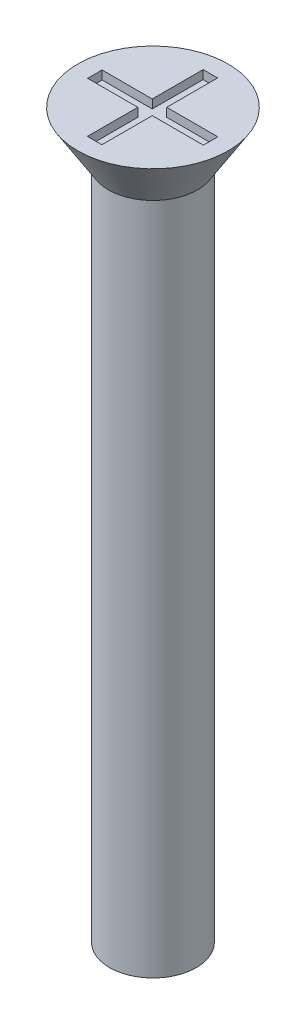
ISO-10303-21;
HEADER;
FILE_DESCRIPTION(('STEP AP214'),'2;1');
FILE_NAME('part.step','',(''),(''),'','','');
FILE_SCHEMA(('AUTOMOTIVE_DESIGN { 1 0 10303 214 1 1 1 1 }'));
ENDSEC;
DATA;
#1=APPLICATION_CONTEXT('core data for automotive mechanical design processes');
#2=APPLICATION_PROTOCOL_DEFINITION('international standard','automotive_design',2000,#1);
#3=PRODUCT_CONTEXT('',#1,'mechanical');
#4=PRODUCT('Part','Part','',(#3));
#5=PRODUCT_RELATED_PRODUCT_CATEGORY('part','',(#4));
#6=PRODUCT_DEFINITION_FORMATION('','',#4);
#7=PRODUCT_DEFINITION_CONTEXT('part definition',#1,'design');
#8=PRODUCT_DEFINITION('design','',#6,#7);
#9=PRODUCT_DEFINITION_SHAPE('','',#8);
#10=(LENGTH_UNIT() NAMED_UNIT(*) SI_UNIT(.MILLI.,.METRE.));
#11=(NAMED_UNIT(*) PLANE_ANGLE_UNIT() SI_UNIT($,.RADIAN.));
#12=(NAMED_UNIT(*) SI_UNIT($,.STERADIAN.) SOLID_ANGLE_UNIT());
#13=UNCERTAINTY_MEASURE_WITH_UNIT(LENGTH_MEASURE(1.E-05),#10,'distance_accuracy_value','');
#14=(GEOMETRIC_REPRESENTATION_CONTEXT(3) GLOBAL_UNCERTAINTY_ASSIGNED_CONTEXT((#13)) GLOBAL_UNIT_ASSIGNED_CONTEXT((#10,
#11,#12)) REPRESENTATION_CONTEXT('',''));
#15=CARTESIAN_POINT('',(0.,0.,0.));
#16=DIRECTION('',(0.,0.,1.));
#17=DIRECTION('',(1.,0.,0.));
#18=AXIS2_PLACEMENT_3D('',#15,#16,#17);
#19=CARTESIAN_POINT('',(0.,25.,0.));
#20=DIRECTION('',(0.,1.,0.));
#21=DIRECTION('',(0.,0.,1.));
#22=AXIS2_PLACEMENT_3D('',#19,#20,#21);
#23=PLANE('',#22);
#24=CARTESIAN_POINT('',(0.,25.,0.));
#25=DIRECTION('',(0.,1.,0.));
#26=DIRECTION('',(0.,0.,1.));
#27=AXIS2_PLACEMENT_3D('',#24,#25,#26);
#28=CIRCLE('',#27,2.6);
#29=CARTESIAN_POINT('',(0.,25.,2.6));
#30=VERTEX_POINT('',#29);
#31=EDGE_CURVE('E192',#30,#30,#28,.T.);
#32=ORIENTED_EDGE('',*,*,#31,.T.);
#33=EDGE_LOOP('',(#32));
#34=FACE_BOUND('',#33,.T.);
#35=DIRECTION('',(1.,0.,0.));
#36=VECTOR('',#35,1.);
#37=CARTESIAN_POINT('',(0.,25.,-2.));
#38=LINE('',#37,#36);
#39=CARTESIAN_POINT('',(-0.265272843023468,25.,-2.));
#40=VERTEX_POINT('',#39);
#41=CARTESIAN_POINT('',(0.234727156976532,25.,-2.));
#42=VERTEX_POINT('',#41);
#43=EDGE_CURVE('E161',#40,#42,#38,.T.);
#44=ORIENTED_EDGE('',*,*,#43,.T.);
#45=DIRECTION('',(0.,0.,1.));
#46=VECTOR('',#45,1.);
#47=CARTESIAN_POINT('',(0.234727156976532,25.,0.));
#48=LINE('',#47,#46);
#49=CARTESIAN_POINT('',(0.234727156976532,25.,-0.241621514992573));
#50=VERTEX_POINT('',#49);
#51=EDGE_CURVE('E48',#42,#50,#48,.T.);
#52=ORIENTED_EDGE('',*,*,#51,.T.);
#53=DIRECTION('',(1.,0.,0.));
#54=VECTOR('',#53,1.);
#55=CARTESIAN_POINT('',(0.,25.,-0.241621514992573));
#56=LINE('',#55,#54);
#57=CARTESIAN_POINT('',(2.,25.,-0.241621514992573));
#58=VERTEX_POINT('',#57);
#59=EDGE_CURVE('E98',#50,#58,#56,.T.);
#60=ORIENTED_EDGE('',*,*,#59,.T.);
#61=DIRECTION('',(0.,0.,1.));
#62=VECTOR('',#61,1.);
#63=CARTESIAN_POINT('',(2.,25.,0.));
#64=LINE('',#63,#62);
#65=CARTESIAN_POINT('',(2.,25.,0.258378485007427));
#66=VERTEX_POINT('',#65);
#67=EDGE_CURVE('E186',#58,#66,#64,.T.);
#68=ORIENTED_EDGE('',*,*,#67,.T.);
#69=DIRECTION('',(1.,0.,0.));
#70=VECTOR('',#69,1.);
#71=CARTESIAN_POINT('',(0.,25.,0.258378485007427));
#72=LINE('',#71,#70);
#73=CARTESIAN_POINT('',(0.234727156976532,25.,0.258378485007427));
#74=VERTEX_POINT('',#73);
#75=EDGE_CURVE('E145',#74,#66,#72,.T.);
#76=ORIENTED_EDGE('',*,*,#75,.F.);
#77=DIRECTION('',(0.,0.,1.));
#78=VECTOR('',#77,1.);
#79=CARTESIAN_POINT('',(0.234727156976532,25.,0.));
#80=LINE('',#79,#78);
#81=CARTESIAN_POINT('',(0.234727156976533,25.,2.));
#82=VERTEX_POINT('',#81);
#83=EDGE_CURVE('E182',#74,#82,#80,.T.);
#84=ORIENTED_EDGE('',*,*,#83,.T.);
#85=DIRECTION('',(1.,0.,0.));
#86=VECTOR('',#85,1.);
#87=CARTESIAN_POINT('',(0.,25.,2.));
#88=LINE('',#87,#86);
#89=CARTESIAN_POINT('',(-0.265272843023467,25.,2.));
#90=VERTEX_POINT('',#89);
#91=EDGE_CURVE('E179',#90,#82,#88,.T.);
#92=ORIENTED_EDGE('',*,*,#91,.F.);
#93=DIRECTION('',(0.,0.,1.));
#94=VECTOR('',#93,1.);
#95=CARTESIAN_POINT('',(-0.265272843023468,25.,0.));
#96=LINE('',#95,#94);
#97=CARTESIAN_POINT('',(-0.265272843023468,25.,0.258378485007427));
#98=VERTEX_POINT('',#97);
#99=EDGE_CURVE('E176',#98,#90,#96,.T.);
#100=ORIENTED_EDGE('',*,*,#99,.F.);
#101=DIRECTION('',(1.,0.,0.));
#102=VECTOR('',#101,1.);
#103=CARTESIAN_POINT('',(0.,25.,0.258378485007427));
#104=LINE('',#103,#102);
#105=CARTESIAN_POINT('',(-2.,25.,0.258378485007427));
#106=VERTEX_POINT('',#105);
#107=EDGE_CURVE('E173',#106,#98,#104,.T.);
#108=ORIENTED_EDGE('',*,*,#107,.F.);
#109=DIRECTION('',(0.,0.,1.));
#110=VECTOR('',#109,1.);
#111=CARTESIAN_POINT('',(-2.,25.,0.));
#112=LINE('',#111,#110);
#113=CARTESIAN_POINT('',(-2.,25.,-0.241621514992573));
#114=VERTEX_POINT('',#113);
#115=EDGE_CURVE('E170',#114,#106,#112,.T.);
#116=ORIENTED_EDGE('',*,*,#115,.F.);
#117=DIRECTION('',(1.,0.,0.));
#118=VECTOR('',#117,1.);
#119=CARTESIAN_POINT('',(0.,25.,-0.241621514992573));
#120=LINE('',#119,#118);
#121=CARTESIAN_POINT('',(-0.265272843023468,25.,-0.241621514992573));
#122=VERTEX_POINT('',#121);
#123=EDGE_CURVE('E167',#114,#122,#120,.T.);
#124=ORIENTED_EDGE('',*,*,#123,.T.);
#125=DIRECTION('',(0.,0.,1.));
#126=VECTOR('',#125,1.);
#127=CARTESIAN_POINT('',(-0.265272843023468,25.,0.));
#128=LINE('',#127,#126);
#129=EDGE_CURVE('E164',#40,#122,#128,.T.);
#130=ORIENTED_EDGE('',*,*,#129,.F.);
#131=EDGE_LOOP('',(#44,#52,#60,#68,#76,#84,#92,#100,#108,#116,#124,#130));
#132=FACE_BOUND('',#131,.T.);
#133=ADVANCED_FACE('F33',(#34,#132),#23,.T.);
#134=CARTESIAN_POINT('',(0.,25.,0.));
#135=DIRECTION('',(0.,-1.,0.));
#136=DIRECTION('',(0.,0.,-1.));
#137=AXIS2_PLACEMENT_3D('',#134,#135,#136);
#138=CYLINDRICAL_SURFACE('',#137,1.5);
#139=CARTESIAN_POINT('',(0.,0.,0.));
#140=DIRECTION('',(0.,1.,0.));
#141=DIRECTION('',(0.,0.,1.));
#142=AXIS2_PLACEMENT_3D('',#139,#140,#141);
#143=CIRCLE('',#142,1.5);
#144=CARTESIAN_POINT('',(0.,0.,1.5));
#145=VERTEX_POINT('',#144);
#146=EDGE_CURVE('E41',#145,#145,#143,.T.);
#147=ORIENTED_EDGE('',*,*,#146,.T.);
#148=EDGE_LOOP('',(#147));
#149=FACE_BOUND('',#148,.T.);
#150=CARTESIAN_POINT('',(0.,23.3,0.));
#151=DIRECTION('',(0.,1.,0.));
#152=DIRECTION('',(0.,0.,1.));
#153=AXIS2_PLACEMENT_3D('',#150,#151,#152);
#154=CIRCLE('',#153,1.5);
#155=CARTESIAN_POINT('',(0.,23.3,1.5));
#156=VERTEX_POINT('',#155);
#157=EDGE_CURVE('E11',#156,#156,#154,.T.);
#158=ORIENTED_EDGE('',*,*,#157,.F.);
#159=EDGE_LOOP('',(#158));
#160=FACE_BOUND('',#159,.T.);
#161=ADVANCED_FACE('F35',(#149,#160),#138,.T.);
#162=CARTESIAN_POINT('',(0.,0.,0.));
#163=DIRECTION('',(0.,1.,0.));
#164=DIRECTION('',(0.,0.,1.));
#165=AXIS2_PLACEMENT_3D('',#162,#163,#164);
#166=PLANE('',#165);
#167=ORIENTED_EDGE('',*,*,#146,.F.);
#168=EDGE_LOOP('',(#167));
#169=FACE_BOUND('',#168,.T.);
#170=ADVANCED_FACE('F219',(#169),#166,.F.);
#171=CARTESIAN_POINT('',(0.,25.,0.));
#172=DIRECTION('',(0.,1.,0.));
#173=DIRECTION('',(0.,0.,1.));
#174=AXIS2_PLACEMENT_3D('',#171,#172,#173);
#175=CONICAL_SURFACE('',#174,2.6,0.558505360638187);
#176=CARTESIAN_POINT('',(0.,23.3,0.));
#177=DIRECTION('',(0.,1.,0.));
#178=DIRECTION('',(0.,0.,1.));
#179=AXIS2_PLACEMENT_3D('',#176,#177,#178);
#180=CIRCLE('',#179,1.53772210175414);
#181=CARTESIAN_POINT('',(0.,23.3,1.53772210175414));
#182=VERTEX_POINT('',#181);
#183=EDGE_CURVE('E212',#182,#182,#180,.T.);
#184=ORIENTED_EDGE('',*,*,#183,.T.);
#185=EDGE_LOOP('',(#184));
#186=FACE_BOUND('',#185,.T.);
#187=ORIENTED_EDGE('',*,*,#31,.F.);
#188=EDGE_LOOP('',(#187));
#189=FACE_BOUND('',#188,.T.);
#190=ADVANCED_FACE('F221',(#186,#189),#175,.T.);
#191=CARTESIAN_POINT('',(0.,23.3,0.));
#192=DIRECTION('',(0.,1.,0.));
#193=DIRECTION('',(0.,0.,1.));
#194=AXIS2_PLACEMENT_3D('',#191,#192,#193);
#195=PLANE('',#194);
#196=ORIENTED_EDGE('',*,*,#157,.T.);
#197=EDGE_LOOP('',(#196));
#198=FACE_BOUND('',#197,.T.);
#199=ORIENTED_EDGE('',*,*,#183,.F.);
#200=EDGE_LOOP('',(#199));
#201=FACE_BOUND('',#200,.T.);
#202=ADVANCED_FACE('F226',(#198,#201),#195,.F.);
#203=CARTESIAN_POINT('',(0.234727156976532,24.7,0.));
#204=DIRECTION('',(-1.,0.,0.));
#205=DIRECTION('',(0.,0.,1.));
#206=AXIS2_PLACEMENT_3D('',#203,#204,#205);
#207=PLANE('',#206);
#208=ORIENTED_EDGE('',*,*,#51,.F.);
#209=DIRECTION('',(0.,1.,0.));
#210=VECTOR('',#209,1.);
#211=CARTESIAN_POINT('',(0.234727156976532,24.7,-2.));
#212=LINE('',#211,#210);
#213=CARTESIAN_POINT('',(0.234727156976532,24.7,-2.));
#214=VERTEX_POINT('',#213);
#215=EDGE_CURVE('E159',#214,#42,#212,.T.);
#216=ORIENTED_EDGE('',*,*,#215,.F.);
#217=DIRECTION('',(0.,0.,1.));
#218=VECTOR('',#217,1.);
#219=CARTESIAN_POINT('',(0.234727156976532,24.7,0.));
#220=LINE('',#219,#218);
#221=CARTESIAN_POINT('',(0.234727156976532,24.7,-0.241621514992573));
#222=VERTEX_POINT('',#221);
#223=EDGE_CURVE('E189',#214,#222,#220,.T.);
#224=ORIENTED_EDGE('',*,*,#223,.T.);
#225=DIRECTION('',(0.,1.,0.));
#226=VECTOR('',#225,1.);
#227=CARTESIAN_POINT('',(0.234727156976532,24.7,-0.241621514992573));
#228=LINE('',#227,#226);
#229=EDGE_CURVE('E190',#222,#50,#228,.T.);
#230=ORIENTED_EDGE('',*,*,#229,.T.);
#231=EDGE_LOOP('',(#208,#216,#224,#230));
#232=FACE_BOUND('',#231,.T.);
#233=ADVANCED_FACE('F238',(#232),#207,.T.);
#234=CARTESIAN_POINT('',(0.,24.7,-0.241621514992573));
#235=DIRECTION('',(0.,0.,1.));
#236=DIRECTION('',(1.,0.,0.));
#237=AXIS2_PLACEMENT_3D('',#234,#235,#236);
#238=PLANE('',#237);
#239=ORIENTED_EDGE('',*,*,#59,.F.);
#240=ORIENTED_EDGE('',*,*,#229,.F.);
#241=DIRECTION('',(1.,0.,0.));
#242=VECTOR('',#241,1.);
#243=CARTESIAN_POINT('',(0.,24.7,-0.241621514992573));
#244=LINE('',#243,#242);
#245=CARTESIAN_POINT('',(2.,24.7,-0.241621514992573));
#246=VERTEX_POINT('',#245);
#247=EDGE_CURVE('E57',#222,#246,#244,.T.);
#248=ORIENTED_EDGE('',*,*,#247,.T.);
#249=DIRECTION('',(0.,1.,0.));
#250=VECTOR('',#249,1.);
#251=CARTESIAN_POINT('',(2.,24.7,-0.241621514992573));
#252=LINE('',#251,#250);
#253=EDGE_CURVE('E137',#246,#58,#252,.T.);
#254=ORIENTED_EDGE('',*,*,#253,.T.);
#255=EDGE_LOOP('',(#239,#240,#248,#254));
#256=FACE_BOUND('',#255,.T.);
#257=ADVANCED_FACE('F242',(#256),#238,.T.);
#258=CARTESIAN_POINT('',(2.,24.7,0.));
#259=DIRECTION('',(-1.,0.,0.));
#260=DIRECTION('',(0.,0.,1.));
#261=AXIS2_PLACEMENT_3D('',#258,#259,#260);
#262=PLANE('',#261);
#263=ORIENTED_EDGE('',*,*,#67,.F.);
#264=ORIENTED_EDGE('',*,*,#253,.F.);
#265=DIRECTION('',(0.,0.,1.));
#266=VECTOR('',#265,1.);
#267=CARTESIAN_POINT('',(2.,24.7,0.));
#268=LINE('',#267,#266);
#269=CARTESIAN_POINT('',(2.,24.7,0.258378485007427));
#270=VERTEX_POINT('',#269);
#271=EDGE_CURVE('E131',#246,#270,#268,.T.);
#272=ORIENTED_EDGE('',*,*,#271,.T.);
#273=DIRECTION('',(0.,1.,0.));
#274=VECTOR('',#273,1.);
#275=CARTESIAN_POINT('',(2.,24.7,0.258378485007427));
#276=LINE('',#275,#274);
#277=EDGE_CURVE('E135',#270,#66,#276,.T.);
#278=ORIENTED_EDGE('',*,*,#277,.T.);
#279=EDGE_LOOP('',(#263,#264,#272,#278));
#280=FACE_BOUND('',#279,.T.);
#281=ADVANCED_FACE('F134',(#280),#262,.T.);
#282=CARTESIAN_POINT('',(0.,24.7,0.258378485007427));
#283=DIRECTION('',(0.,0.,1.));
#284=DIRECTION('',(1.,0.,0.));
#285=AXIS2_PLACEMENT_3D('',#282,#283,#284);
#286=PLANE('',#285);
#287=ORIENTED_EDGE('',*,*,#75,.T.);
#288=ORIENTED_EDGE('',*,*,#277,.F.);
#289=DIRECTION('',(1.,0.,0.));
#290=VECTOR('',#289,1.);
#291=CARTESIAN_POINT('',(0.,24.7,0.258378485007427));
#292=LINE('',#291,#290);
#293=CARTESIAN_POINT('',(0.234727156976532,24.7,0.258378485007427));
#294=VERTEX_POINT('',#293);
#295=EDGE_CURVE('E139',#294,#270,#292,.T.);
#296=ORIENTED_EDGE('',*,*,#295,.F.);
#297=DIRECTION('',(0.,1.,0.));
#298=VECTOR('',#297,1.);
#299=CARTESIAN_POINT('',(0.234727156976532,24.7,0.258378485007427));
#300=LINE('',#299,#298);
#301=EDGE_CURVE('E147',#294,#74,#300,.T.);
#302=ORIENTED_EDGE('',*,*,#301,.T.);
#303=EDGE_LOOP('',(#287,#288,#296,#302));
#304=FACE_BOUND('',#303,.T.);
#305=ADVANCED_FACE('F143',(#304),#286,.F.);
#306=CARTESIAN_POINT('',(0.234727156976532,24.7,0.));
#307=DIRECTION('',(-1.,0.,0.));
#308=DIRECTION('',(0.,0.,1.));
#309=AXIS2_PLACEMENT_3D('',#306,#307,#308);
#310=PLANE('',#309);
#311=ORIENTED_EDGE('',*,*,#83,.F.);
#312=ORIENTED_EDGE('',*,*,#301,.F.);
#313=DIRECTION('',(0.,0.,1.));
#314=VECTOR('',#313,1.);
#315=CARTESIAN_POINT('',(0.234727156976532,24.7,0.));
#316=LINE('',#315,#314);
#317=CARTESIAN_POINT('',(0.234727156976533,24.7,2.));
#318=VERTEX_POINT('',#317);
#319=EDGE_CURVE('E152',#294,#318,#316,.T.);
#320=ORIENTED_EDGE('',*,*,#319,.T.);
#321=DIRECTION('',(0.,1.,0.));
#322=VECTOR('',#321,1.);
#323=CARTESIAN_POINT('',(0.234727156976533,24.7,2.));
#324=LINE('',#323,#322);
#325=EDGE_CURVE('E195',#318,#82,#324,.T.);
#326=ORIENTED_EDGE('',*,*,#325,.T.);
#327=EDGE_LOOP('',(#311,#312,#320,#326));
#328=FACE_BOUND('',#327,.T.);
#329=ADVANCED_FACE('F269',(#328),#310,.T.);
#330=CARTESIAN_POINT('',(0.,24.7,2.));
#331=DIRECTION('',(0.,0.,1.));
#332=DIRECTION('',(1.,0.,0.));
#333=AXIS2_PLACEMENT_3D('',#330,#331,#332);
#334=PLANE('',#333);
#335=ORIENTED_EDGE('',*,*,#91,.T.);
#336=ORIENTED_EDGE('',*,*,#325,.F.);
#337=DIRECTION('',(1.,0.,0.));
#338=VECTOR('',#337,1.);
#339=CARTESIAN_POINT('',(0.,24.7,2.));
#340=LINE('',#339,#338);
#341=CARTESIAN_POINT('',(-0.265272843023467,24.7,2.));
#342=VERTEX_POINT('',#341);
#343=EDGE_CURVE('E154',#342,#318,#340,.T.);
#344=ORIENTED_EDGE('',*,*,#343,.F.);
#345=DIRECTION('',(0.,1.,0.));
#346=VECTOR('',#345,1.);
#347=CARTESIAN_POINT('',(-0.265272843023467,24.7,2.));
#348=LINE('',#347,#346);
#349=EDGE_CURVE('E197',#342,#90,#348,.T.);
#350=ORIENTED_EDGE('',*,*,#349,.T.);
#351=EDGE_LOOP('',(#335,#336,#344,#350));
#352=FACE_BOUND('',#351,.T.);
#353=ADVANCED_FACE('F265',(#352),#334,.F.);
#354=CARTESIAN_POINT('',(-0.265272843023468,24.7,0.));
#355=DIRECTION('',(-1.,0.,0.));
#356=DIRECTION('',(0.,0.,1.));
#357=AXIS2_PLACEMENT_3D('',#354,#355,#356);
#358=PLANE('',#357);
#359=ORIENTED_EDGE('',*,*,#99,.T.);
#360=ORIENTED_EDGE('',*,*,#349,.F.);
#361=DIRECTION('',(0.,0.,1.));
#362=VECTOR('',#361,1.);
#363=CARTESIAN_POINT('',(-0.265272843023468,24.7,0.));
#364=LINE('',#363,#362);
#365=CARTESIAN_POINT('',(-0.265272843023468,24.7,0.258378485007427));
#366=VERTEX_POINT('',#365);
#367=EDGE_CURVE('E417',#366,#342,#364,.T.);
#368=ORIENTED_EDGE('',*,*,#367,.F.);
#369=DIRECTION('',(0.,1.,0.));
#370=VECTOR('',#369,1.);
#371=CARTESIAN_POINT('',(-0.265272843023468,24.7,0.258378485007427));
#372=LINE('',#371,#370);
#373=EDGE_CURVE('E199',#366,#98,#372,.T.);
#374=ORIENTED_EDGE('',*,*,#373,.T.);
#375=EDGE_LOOP('',(#359,#360,#368,#374));
#376=FACE_BOUND('',#375,.T.);
#377=ADVANCED_FACE('F261',(#376),#358,.F.);
#378=CARTESIAN_POINT('',(0.,24.7,0.258378485007427));
#379=DIRECTION('',(0.,0.,1.));
#380=DIRECTION('',(1.,0.,0.));
#381=AXIS2_PLACEMENT_3D('',#378,#379,#380);
#382=PLANE('',#381);
#383=ORIENTED_EDGE('',*,*,#107,.T.);
#384=ORIENTED_EDGE('',*,*,#373,.F.);
#385=DIRECTION('',(1.,0.,0.));
#386=VECTOR('',#385,1.);
#387=CARTESIAN_POINT('',(0.,24.7,0.258378485007427));
#388=LINE('',#387,#386);
#389=CARTESIAN_POINT('',(-2.,24.7,0.258378485007427));
#390=VERTEX_POINT('',#389);
#391=EDGE_CURVE('E414',#390,#366,#388,.T.);
#392=ORIENTED_EDGE('',*,*,#391,.F.);
#393=DIRECTION('',(0.,1.,0.));
#394=VECTOR('',#393,1.);
#395=CARTESIAN_POINT('',(-2.,24.7,0.258378485007427));
#396=LINE('',#395,#394);
#397=EDGE_CURVE('E201',#390,#106,#396,.T.);
#398=ORIENTED_EDGE('',*,*,#397,.T.);
#399=EDGE_LOOP('',(#383,#384,#392,#398));
#400=FACE_BOUND('',#399,.T.);
#401=ADVANCED_FACE('F257',(#400),#382,.F.);
#402=CARTESIAN_POINT('',(-2.,24.7,0.));
#403=DIRECTION('',(-1.,0.,0.));
#404=DIRECTION('',(0.,0.,1.));
#405=AXIS2_PLACEMENT_3D('',#402,#403,#404);
#406=PLANE('',#405);
#407=ORIENTED_EDGE('',*,*,#115,.T.);
#408=ORIENTED_EDGE('',*,*,#397,.F.);
#409=DIRECTION('',(0.,0.,1.));
#410=VECTOR('',#409,1.);
#411=CARTESIAN_POINT('',(-2.,24.7,0.));
#412=LINE('',#411,#410);
#413=CARTESIAN_POINT('',(-2.,24.7,-0.241621514992573));
#414=VERTEX_POINT('',#413);
#415=EDGE_CURVE('E411',#414,#390,#412,.T.);
#416=ORIENTED_EDGE('',*,*,#415,.F.);
#417=DIRECTION('',(0.,1.,0.));
#418=VECTOR('',#417,1.);
#419=CARTESIAN_POINT('',(-2.,24.7,-0.241621514992573));
#420=LINE('',#419,#418);
#421=EDGE_CURVE('E203',#414,#114,#420,.T.);
#422=ORIENTED_EDGE('',*,*,#421,.T.);
#423=EDGE_LOOP('',(#407,#408,#416,#422));
#424=FACE_BOUND('',#423,.T.);
#425=ADVANCED_FACE('F253',(#424),#406,.F.);
#426=CARTESIAN_POINT('',(0.,24.7,-0.241621514992573));
#427=DIRECTION('',(0.,0.,1.));
#428=DIRECTION('',(1.,0.,0.));
#429=AXIS2_PLACEMENT_3D('',#426,#427,#428);
#430=PLANE('',#429);
#431=ORIENTED_EDGE('',*,*,#123,.F.);
#432=ORIENTED_EDGE('',*,*,#421,.F.);
#433=DIRECTION('',(1.,0.,0.));
#434=VECTOR('',#433,1.);
#435=CARTESIAN_POINT('',(0.,24.7,-0.241621514992573));
#436=LINE('',#435,#434);
#437=CARTESIAN_POINT('',(-0.265272843023468,24.7,-0.241621514992573));
#438=VERTEX_POINT('',#437);
#439=EDGE_CURVE('E409',#414,#438,#436,.T.);
#440=ORIENTED_EDGE('',*,*,#439,.T.);
#441=DIRECTION('',(0.,1.,0.));
#442=VECTOR('',#441,1.);
#443=CARTESIAN_POINT('',(-0.265272843023468,24.7,-0.241621514992573));
#444=LINE('',#443,#442);
#445=EDGE_CURVE('E205',#438,#122,#444,.T.);
#446=ORIENTED_EDGE('',*,*,#445,.T.);
#447=EDGE_LOOP('',(#431,#432,#440,#446));
#448=FACE_BOUND('',#447,.T.);
#449=ADVANCED_FACE('F249',(#448),#430,.T.);
#450=CARTESIAN_POINT('',(-0.265272843023468,24.7,0.));
#451=DIRECTION('',(-1.,0.,0.));
#452=DIRECTION('',(0.,0.,1.));
#453=AXIS2_PLACEMENT_3D('',#450,#451,#452);
#454=PLANE('',#453);
#455=ORIENTED_EDGE('',*,*,#129,.T.);
#456=ORIENTED_EDGE('',*,*,#445,.F.);
#457=DIRECTION('',(0.,0.,1.));
#458=VECTOR('',#457,1.);
#459=CARTESIAN_POINT('',(-0.265272843023468,24.7,0.));
#460=LINE('',#459,#458);
#461=CARTESIAN_POINT('',(-0.265272843023468,24.7,-2.));
#462=VERTEX_POINT('',#461);
#463=EDGE_CURVE('E405',#462,#438,#460,.T.);
#464=ORIENTED_EDGE('',*,*,#463,.F.);
#465=DIRECTION('',(0.,1.,0.));
#466=VECTOR('',#465,1.);
#467=CARTESIAN_POINT('',(-0.265272843023468,24.7,-2.));
#468=LINE('',#467,#466);
#469=EDGE_CURVE('E207',#462,#40,#468,.T.);
#470=ORIENTED_EDGE('',*,*,#469,.T.);
#471=EDGE_LOOP('',(#455,#456,#464,#470));
#472=FACE_BOUND('',#471,.T.);
#473=ADVANCED_FACE('F246',(#472),#454,.F.);
#474=CARTESIAN_POINT('',(0.,24.7,-2.));
#475=DIRECTION('',(0.,0.,1.));
#476=DIRECTION('',(1.,0.,0.));
#477=AXIS2_PLACEMENT_3D('',#474,#475,#476);
#478=PLANE('',#477);
#479=ORIENTED_EDGE('',*,*,#43,.F.);
#480=ORIENTED_EDGE('',*,*,#469,.F.);
#481=DIRECTION('',(1.,0.,0.));
#482=VECTOR('',#481,1.);
#483=CARTESIAN_POINT('',(0.,24.7,-2.));
#484=LINE('',#483,#482);
#485=EDGE_CURVE('E105',#462,#214,#484,.T.);
#486=ORIENTED_EDGE('',*,*,#485,.T.);
#487=ORIENTED_EDGE('',*,*,#215,.T.);
#488=EDGE_LOOP('',(#479,#480,#486,#487));
#489=FACE_BOUND('',#488,.T.);
#490=ADVANCED_FACE('F243',(#489),#478,.T.);
#491=CARTESIAN_POINT('',(0.,24.7,0.));
#492=DIRECTION('',(0.,1.,0.));
#493=DIRECTION('',(0.,0.,1.));
#494=AXIS2_PLACEMENT_3D('',#491,#492,#493);
#495=PLANE('',#494);
#496=ORIENTED_EDGE('',*,*,#223,.F.);
#497=ORIENTED_EDGE('',*,*,#485,.F.);
#498=ORIENTED_EDGE('',*,*,#463,.T.);
#499=ORIENTED_EDGE('',*,*,#439,.F.);
#500=ORIENTED_EDGE('',*,*,#415,.T.);
#501=ORIENTED_EDGE('',*,*,#391,.T.);
#502=ORIENTED_EDGE('',*,*,#367,.T.);
#503=ORIENTED_EDGE('',*,*,#343,.T.);
#504=ORIENTED_EDGE('',*,*,#319,.F.);
#505=ORIENTED_EDGE('',*,*,#295,.T.);
#506=ORIENTED_EDGE('',*,*,#271,.F.);
#507=ORIENTED_EDGE('',*,*,#247,.F.);
#508=EDGE_LOOP('',(#496,#497,#498,#499,#500,#501,#502,#503,#504,#505,#506,#507));
#509=FACE_BOUND('',#508,.T.);
#510=ADVANCED_FACE('F150',(#509),#495,.T.);
#511=CLOSED_SHELL('',(#133,#161,#170,#190,#202,#233,#257,#281,#305,#329,#353,#377,#401,#425,
#449,#473,#490,#510));
#512=MANIFOLD_SOLID_BREP('B2',#511);
#513=ADVANCED_BREP_SHAPE_REPRESENTATION('',(#18,#512),#14);
#514=SHAPE_DEFINITION_REPRESENTATION(#9,#513);
ENDSEC;
END-ISO-10303-21;
